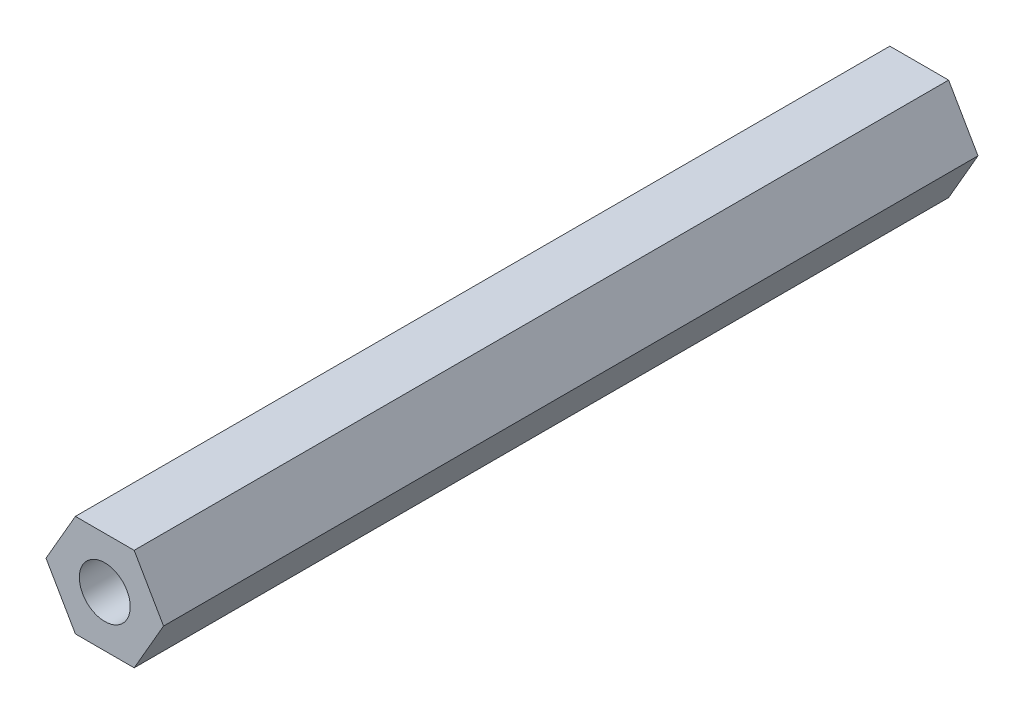
ISO-10303-21;
HEADER;
FILE_DESCRIPTION(('STEP AP214'),'2;1');
FILE_NAME('part.step','',(''),(''),'','','');
FILE_SCHEMA(('AUTOMOTIVE_DESIGN { 1 0 10303 214 1 1 1 1 }'));
ENDSEC;
DATA;
#1=APPLICATION_CONTEXT('core data for automotive mechanical design processes');
#2=APPLICATION_PROTOCOL_DEFINITION('international standard','automotive_design',2000,#1);
#3=PRODUCT_CONTEXT('',#1,'mechanical');
#4=PRODUCT('Part','Part','',(#3));
#5=PRODUCT_RELATED_PRODUCT_CATEGORY('part','',(#4));
#6=PRODUCT_DEFINITION_FORMATION('','',#4);
#7=PRODUCT_DEFINITION_CONTEXT('part definition',#1,'design');
#8=PRODUCT_DEFINITION('design','',#6,#7);
#9=PRODUCT_DEFINITION_SHAPE('','',#8);
#10=(LENGTH_UNIT() NAMED_UNIT(*) SI_UNIT(.MILLI.,.METRE.));
#11=(NAMED_UNIT(*) PLANE_ANGLE_UNIT() SI_UNIT($,.RADIAN.));
#12=(NAMED_UNIT(*) SI_UNIT($,.STERADIAN.) SOLID_ANGLE_UNIT());
#13=UNCERTAINTY_MEASURE_WITH_UNIT(LENGTH_MEASURE(1.E-05),#10,'distance_accuracy_value','');
#14=(GEOMETRIC_REPRESENTATION_CONTEXT(3) GLOBAL_UNCERTAINTY_ASSIGNED_CONTEXT((#13)) GLOBAL_UNIT_ASSIGNED_CONTEXT((#10,
#11,#12)) REPRESENTATION_CONTEXT('',''));
#15=CARTESIAN_POINT('',(0.,0.,0.));
#16=DIRECTION('',(0.,0.,1.));
#17=DIRECTION('',(1.,0.,0.));
#18=AXIS2_PLACEMENT_3D('',#15,#16,#17);
#19=CARTESIAN_POINT('',(0.,6.35,559.282920441985));
#20=DIRECTION('',(0.,-1.,0.));
#21=DIRECTION('',(1.,0.,0.));
#22=AXIS2_PLACEMENT_3D('',#19,#20,#21);
#23=PLANE('',#22);
#24=DIRECTION('',(1.,0.,0.));
#25=VECTOR('',#24,1.);
#26=CARTESIAN_POINT('',(-3.6661742093541,6.35000000000002,412.88335));
#27=LINE('',#26,#25);
#28=CARTESIAN_POINT('',(-3.6661742093541,6.35000000000002,412.88335));
#29=VERTEX_POINT('',#28);
#30=CARTESIAN_POINT('',(3.66617420935413,6.35,412.88335));
#31=VERTEX_POINT('',#30);
#32=EDGE_CURVE('E57',#29,#31,#27,.T.);
#33=ORIENTED_EDGE('',*,*,#32,.F.);
#34=DIRECTION('',(0.,0.,-1.));
#35=VECTOR('',#34,1.);
#36=CARTESIAN_POINT('',(-3.66617420935413,6.35,559.282920441985));
#37=LINE('',#36,#35);
#38=CARTESIAN_POINT('',(-3.66617420935413,6.35,514.483350000005));
#39=VERTEX_POINT('',#38);
#40=EDGE_CURVE('E123',#39,#29,#37,.T.);
#41=ORIENTED_EDGE('',*,*,#40,.F.);
#42=DIRECTION('',(-1.,0.,0.));
#43=VECTOR('',#42,1.);
#44=CARTESIAN_POINT('',(1.41251224281279E-13,6.35,514.483350000005));
#45=LINE('',#44,#43);
#46=CARTESIAN_POINT('',(3.66617420935413,6.35,514.483350000005));
#47=VERTEX_POINT('',#46);
#48=EDGE_CURVE('E147',#47,#39,#45,.T.);
#49=ORIENTED_EDGE('',*,*,#48,.F.);
#50=DIRECTION('',(0.,0.,-1.));
#51=VECTOR('',#50,1.);
#52=CARTESIAN_POINT('',(3.66617420935413,6.35,559.282920441985));
#53=LINE('',#52,#51);
#54=EDGE_CURVE('E64',#47,#31,#53,.T.);
#55=ORIENTED_EDGE('',*,*,#54,.T.);
#56=EDGE_LOOP('',(#33,#41,#49,#55));
#57=FACE_BOUND('',#56,.T.);
#58=ADVANCED_FACE('F40',(#57),#23,.F.);
#59=CARTESIAN_POINT('',(-5.49926131403119,3.175,559.282920441985));
#60=DIRECTION('',(0.866025403784439,-0.5,0.));
#61=DIRECTION('',(0.5,0.866025403784439,0.));
#62=AXIS2_PLACEMENT_3D('',#59,#60,#61);
#63=PLANE('',#62);
#64=DIRECTION('',(0.500000000000002,0.866025403784437,0.));
#65=VECTOR('',#64,1.);
#66=CARTESIAN_POINT('',(-7.33234841870825,0.,412.88335));
#67=LINE('',#66,#65);
#68=CARTESIAN_POINT('',(-7.33234841870825,0.,412.88335));
#69=VERTEX_POINT('',#68);
#70=EDGE_CURVE('E115',#69,#29,#67,.T.);
#71=ORIENTED_EDGE('',*,*,#70,.F.);
#72=DIRECTION('',(0.,0.,-1.));
#73=VECTOR('',#72,1.);
#74=CARTESIAN_POINT('',(-7.33234841870824,0.,559.282920441985));
#75=LINE('',#74,#73);
#76=CARTESIAN_POINT('',(-7.33234841870824,0.,514.483350000005));
#77=VERTEX_POINT('',#76);
#78=EDGE_CURVE('E114',#77,#69,#75,.T.);
#79=ORIENTED_EDGE('',*,*,#78,.F.);
#80=DIRECTION('',(-0.5,-0.866025403784439,0.));
#81=VECTOR('',#80,1.);
#82=CARTESIAN_POINT('',(-5.49926131403126,3.17499999999988,514.483350000005));
#83=LINE('',#82,#81);
#84=EDGE_CURVE('E144',#39,#77,#83,.T.);
#85=ORIENTED_EDGE('',*,*,#84,.F.);
#86=ORIENTED_EDGE('',*,*,#40,.T.);
#87=EDGE_LOOP('',(#71,#79,#85,#86));
#88=FACE_BOUND('',#87,.T.);
#89=ADVANCED_FACE('F154',(#88),#63,.F.);
#90=CARTESIAN_POINT('',(-5.49926131403119,-3.175,559.282920441985));
#91=DIRECTION('',(0.866025403784439,0.5,0.));
#92=DIRECTION('',(-0.5,0.866025403784439,0.));
#93=AXIS2_PLACEMENT_3D('',#90,#91,#92);
#94=PLANE('',#93);
#95=DIRECTION('',(-0.5,0.866025403784439,0.));
#96=VECTOR('',#95,1.);
#97=CARTESIAN_POINT('',(-3.66617420935412,-6.35000000000001,412.88335));
#98=LINE('',#97,#96);
#99=CARTESIAN_POINT('',(-3.66617420935412,-6.35000000000001,412.88335));
#100=VERTEX_POINT('',#99);
#101=EDGE_CURVE('E98',#100,#69,#98,.T.);
#102=ORIENTED_EDGE('',*,*,#101,.F.);
#103=DIRECTION('',(0.,0.,-1.));
#104=VECTOR('',#103,1.);
#105=CARTESIAN_POINT('',(-3.66617420935412,-6.35000000000001,559.282920441985));
#106=LINE('',#105,#104);
#107=CARTESIAN_POINT('',(-3.66617420935412,-6.35000000000001,514.483350000005));
#108=VERTEX_POINT('',#107);
#109=EDGE_CURVE('E111',#108,#100,#106,.T.);
#110=ORIENTED_EDGE('',*,*,#109,.F.);
#111=DIRECTION('',(0.5,-0.866025403784439,0.));
#112=VECTOR('',#111,1.);
#113=CARTESIAN_POINT('',(-5.49926131403104,-3.17500000000024,514.483350000005));
#114=LINE('',#113,#112);
#115=EDGE_CURVE('E142',#77,#108,#114,.T.);
#116=ORIENTED_EDGE('',*,*,#115,.F.);
#117=ORIENTED_EDGE('',*,*,#78,.T.);
#118=EDGE_LOOP('',(#102,#110,#116,#117));
#119=FACE_BOUND('',#118,.T.);
#120=ADVANCED_FACE('F110',(#119),#94,.F.);
#121=CARTESIAN_POINT('',(0.,-6.35000000000001,559.282920441985));
#122=DIRECTION('',(0.,1.,0.));
#123=DIRECTION('',(-1.,0.,0.));
#124=AXIS2_PLACEMENT_3D('',#121,#122,#123);
#125=PLANE('',#124);
#126=DIRECTION('',(-1.,0.,0.));
#127=VECTOR('',#126,1.);
#128=CARTESIAN_POINT('',(3.66617420935406,-6.35000000000004,412.88335));
#129=LINE('',#128,#127);
#130=CARTESIAN_POINT('',(3.66617420935406,-6.35000000000004,412.88335));
#131=VERTEX_POINT('',#130);
#132=EDGE_CURVE('E94',#131,#100,#129,.T.);
#133=ORIENTED_EDGE('',*,*,#132,.F.);
#134=DIRECTION('',(0.,0.,-1.));
#135=VECTOR('',#134,1.);
#136=CARTESIAN_POINT('',(3.66617420935413,-6.35,559.282920441985));
#137=LINE('',#136,#135);
#138=CARTESIAN_POINT('',(3.66617420935413,-6.35,514.483350000005));
#139=VERTEX_POINT('',#138);
#140=EDGE_CURVE('E119',#139,#131,#137,.T.);
#141=ORIENTED_EDGE('',*,*,#140,.F.);
#142=DIRECTION('',(1.,0.,0.));
#143=VECTOR('',#142,1.);
#144=CARTESIAN_POINT('',(1.47260482676227E-13,-6.35000000000001,514.483350000005));
#145=LINE('',#144,#143);
#146=EDGE_CURVE('E49',#108,#139,#145,.T.);
#147=ORIENTED_EDGE('',*,*,#146,.F.);
#148=ORIENTED_EDGE('',*,*,#109,.T.);
#149=EDGE_LOOP('',(#133,#141,#147,#148));
#150=FACE_BOUND('',#149,.T.);
#151=ADVANCED_FACE('F117',(#150),#125,.F.);
#152=CARTESIAN_POINT('',(5.49926131403119,-3.175,559.282920441985));
#153=DIRECTION('',(-0.866025403784439,0.5,0.));
#154=DIRECTION('',(-0.5,-0.866025403784439,0.));
#155=AXIS2_PLACEMENT_3D('',#152,#153,#154);
#156=PLANE('',#155);
#157=DIRECTION('',(-0.500000000000008,-0.866025403784434,0.));
#158=VECTOR('',#157,1.);
#159=CARTESIAN_POINT('',(7.33234841870825,0.,412.88335));
#160=LINE('',#159,#158);
#161=CARTESIAN_POINT('',(7.33234841870825,0.,412.88335));
#162=VERTEX_POINT('',#161);
#163=EDGE_CURVE('E101',#162,#131,#160,.T.);
#164=ORIENTED_EDGE('',*,*,#163,.F.);
#165=DIRECTION('',(0.,0.,-1.));
#166=VECTOR('',#165,1.);
#167=CARTESIAN_POINT('',(7.33234841870825,0.,559.282920441985));
#168=LINE('',#167,#166);
#169=CARTESIAN_POINT('',(7.33234841870825,0.,514.483350000005));
#170=VERTEX_POINT('',#169);
#171=EDGE_CURVE('E121',#170,#162,#168,.T.);
#172=ORIENTED_EDGE('',*,*,#171,.F.);
#173=DIRECTION('',(0.5,0.866025403784439,0.));
#174=VECTOR('',#173,1.);
#175=CARTESIAN_POINT('',(5.49926131403112,-3.17500000000012,514.483350000005));
#176=LINE('',#175,#174);
#177=EDGE_CURVE('E11',#139,#170,#176,.T.);
#178=ORIENTED_EDGE('',*,*,#177,.F.);
#179=ORIENTED_EDGE('',*,*,#140,.T.);
#180=EDGE_LOOP('',(#164,#172,#178,#179));
#181=FACE_BOUND('',#180,.T.);
#182=ADVANCED_FACE('F159',(#181),#156,.F.);
#183=CARTESIAN_POINT('',(5.49926131403119,3.17500000000001,559.282920441985));
#184=DIRECTION('',(-0.866025403784438,-0.500000000000001,0.));
#185=DIRECTION('',(0.500000000000001,-0.866025403784438,0.));
#186=AXIS2_PLACEMENT_3D('',#183,#184,#185);
#187=PLANE('',#186);
#188=DIRECTION('',(0.499999999999994,-0.866025403784442,0.));
#189=VECTOR('',#188,1.);
#190=CARTESIAN_POINT('',(3.66617420935416,6.34999999999998,412.88335));
#191=LINE('',#190,#189);
#192=EDGE_CURVE('E136',#31,#162,#191,.T.);
#193=ORIENTED_EDGE('',*,*,#192,.F.);
#194=ORIENTED_EDGE('',*,*,#54,.F.);
#195=DIRECTION('',(-0.500000000000001,0.866025403784438,0.));
#196=VECTOR('',#195,1.);
#197=CARTESIAN_POINT('',(5.49926131403133,3.17499999999976,514.483350000005));
#198=LINE('',#197,#196);
#199=EDGE_CURVE('E129',#170,#47,#198,.T.);
#200=ORIENTED_EDGE('',*,*,#199,.F.);
#201=ORIENTED_EDGE('',*,*,#171,.T.);
#202=EDGE_LOOP('',(#193,#194,#200,#201));
#203=FACE_BOUND('',#202,.T.);
#204=ADVANCED_FACE('F157',(#203),#187,.F.);
#205=CARTESIAN_POINT('',(0.,0.,0.));
#206=DIRECTION('',(0.,0.,1.));
#207=DIRECTION('',(1.,0.,0.));
#208=AXIS2_PLACEMENT_3D('',#205,#206,#207);
#209=CYLINDRICAL_SURFACE('',#208,3.17499999999746);
#210=CARTESIAN_POINT('',(0.,0.,514.483350000005));
#211=DIRECTION('',(0.,0.,1.));
#212=DIRECTION('',(0.,-1.,0.));
#213=AXIS2_PLACEMENT_3D('',#210,#211,#212);
#214=CIRCLE('',#213,3.17499999999746);
#215=CARTESIAN_POINT('',(0.,-3.17499999999746,514.483350000005));
#216=VERTEX_POINT('',#215);
#217=EDGE_CURVE('E130',#216,#216,#214,.T.);
#218=ORIENTED_EDGE('',*,*,#217,.T.);
#219=EDGE_LOOP('',(#218));
#220=FACE_BOUND('',#219,.T.);
#221=CARTESIAN_POINT('',(0.,0.,412.88335));
#222=DIRECTION('',(0.,0.,-1.));
#223=DIRECTION('',(-1.,0.,0.));
#224=AXIS2_PLACEMENT_3D('',#221,#222,#223);
#225=CIRCLE('',#224,3.17499999999746);
#226=CARTESIAN_POINT('',(-3.17499999999746,0.,412.88335));
#227=VERTEX_POINT('',#226);
#228=EDGE_CURVE('E44',#227,#227,#225,.F.);
#229=ORIENTED_EDGE('',*,*,#228,.F.);
#230=EDGE_LOOP('',(#229));
#231=FACE_BOUND('',#230,.T.);
#232=ADVANCED_FACE('F166',(#220,#231),#209,.F.);
#233=CARTESIAN_POINT('',(7.77874999999913,-13.4731902193747,514.483350000006));
#234=DIRECTION('',(0.,0.,1.));
#235=DIRECTION('',(0.5,-0.866025403784438,0.));
#236=AXIS2_PLACEMENT_3D('',#233,#234,#235);
#237=PLANE('',#236);
#238=ORIENTED_EDGE('',*,*,#217,.F.);
#239=EDGE_LOOP('',(#238));
#240=FACE_BOUND('',#239,.T.);
#241=ORIENTED_EDGE('',*,*,#199,.T.);
#242=ORIENTED_EDGE('',*,*,#48,.T.);
#243=ORIENTED_EDGE('',*,*,#84,.T.);
#244=ORIENTED_EDGE('',*,*,#115,.T.);
#245=ORIENTED_EDGE('',*,*,#146,.T.);
#246=ORIENTED_EDGE('',*,*,#177,.T.);
#247=EDGE_LOOP('',(#241,#242,#243,#244,#245,#246));
#248=FACE_BOUND('',#247,.T.);
#249=ADVANCED_FACE('F42',(#240,#248),#237,.T.);
#250=CARTESIAN_POINT('',(0.,0.,412.88335));
#251=DIRECTION('',(0.,0.,-1.));
#252=DIRECTION('',(-1.,0.,0.));
#253=AXIS2_PLACEMENT_3D('',#250,#251,#252);
#254=PLANE('',#253);
#255=ORIENTED_EDGE('',*,*,#132,.T.);
#256=ORIENTED_EDGE('',*,*,#101,.T.);
#257=ORIENTED_EDGE('',*,*,#70,.T.);
#258=ORIENTED_EDGE('',*,*,#32,.T.);
#259=ORIENTED_EDGE('',*,*,#192,.T.);
#260=ORIENTED_EDGE('',*,*,#163,.T.);
#261=EDGE_LOOP('',(#255,#256,#257,#258,#259,#260));
#262=FACE_BOUND('',#261,.T.);
#263=ORIENTED_EDGE('',*,*,#228,.T.);
#264=EDGE_LOOP('',(#263));
#265=FACE_BOUND('',#264,.T.);
#266=ADVANCED_FACE('F96',(#262,#265),#254,.T.);
#267=CLOSED_SHELL('',(#58,#89,#120,#151,#182,#204,#232,#249,#266));
#268=MANIFOLD_SOLID_BREP('B2',#267);
#269=ADVANCED_BREP_SHAPE_REPRESENTATION('',(#18,#268),#14);
#270=SHAPE_DEFINITION_REPRESENTATION(#9,#269);
ENDSEC;
END-ISO-10303-21;
